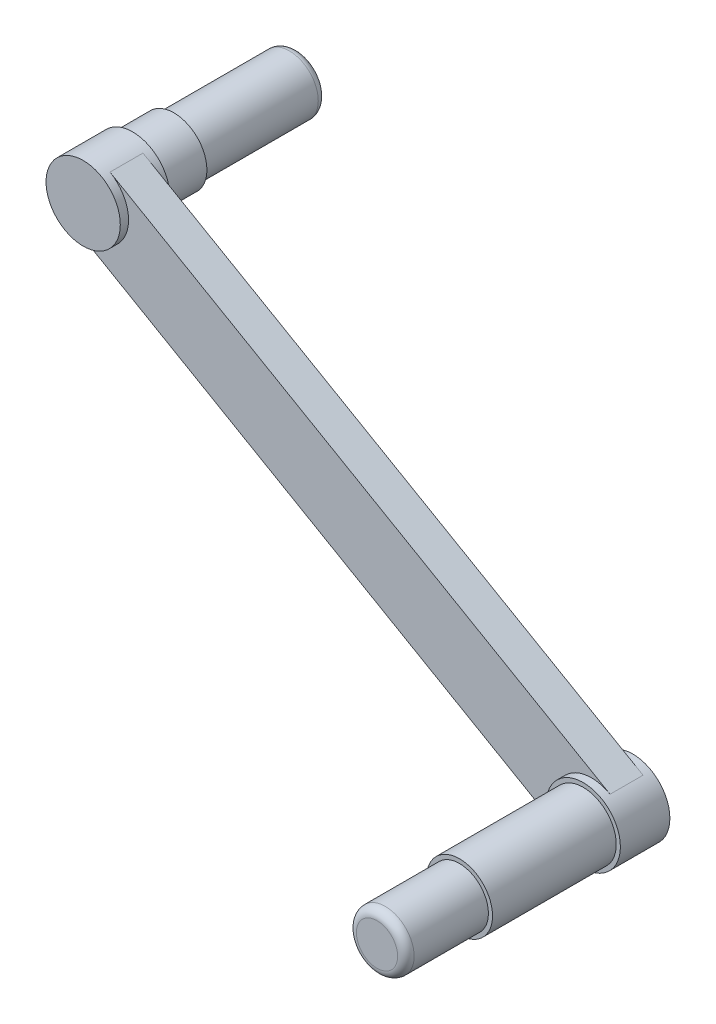
ISO-10303-21;
HEADER;
FILE_DESCRIPTION(('STEP AP214'),'2;1');
FILE_NAME('part.step','',(''),(''),'','','');
FILE_SCHEMA(('AUTOMOTIVE_DESIGN { 1 0 10303 214 1 1 1 1 }'));
ENDSEC;
DATA;
#1=APPLICATION_CONTEXT('core data for automotive mechanical design processes');
#2=APPLICATION_PROTOCOL_DEFINITION('international standard','automotive_design',2000,#1);
#3=PRODUCT_CONTEXT('',#1,'mechanical');
#4=PRODUCT('Part','Part','',(#3));
#5=PRODUCT_RELATED_PRODUCT_CATEGORY('part','',(#4));
#6=PRODUCT_DEFINITION_FORMATION('','',#4);
#7=PRODUCT_DEFINITION_CONTEXT('part definition',#1,'design');
#8=PRODUCT_DEFINITION('design','',#6,#7);
#9=PRODUCT_DEFINITION_SHAPE('','',#8);
#10=(LENGTH_UNIT() NAMED_UNIT(*) SI_UNIT(.MILLI.,.METRE.));
#11=(NAMED_UNIT(*) PLANE_ANGLE_UNIT() SI_UNIT($,.RADIAN.));
#12=(NAMED_UNIT(*) SI_UNIT($,.STERADIAN.) SOLID_ANGLE_UNIT());
#13=UNCERTAINTY_MEASURE_WITH_UNIT(LENGTH_MEASURE(1.E-05),#10,'distance_accuracy_value','');
#14=(GEOMETRIC_REPRESENTATION_CONTEXT(3) GLOBAL_UNCERTAINTY_ASSIGNED_CONTEXT((#13)) GLOBAL_UNIT_ASSIGNED_CONTEXT((#10,
#11,#12)) REPRESENTATION_CONTEXT('',''));
#15=CARTESIAN_POINT('',(0.,0.,0.));
#16=DIRECTION('',(0.,0.,1.));
#17=DIRECTION('',(1.,0.,0.));
#18=AXIS2_PLACEMENT_3D('',#15,#16,#17);
#19=CARTESIAN_POINT('',(0.,0.,10.));
#20=DIRECTION('',(0.,0.,-1.));
#21=DIRECTION('',(-1.,0.,0.));
#22=AXIS2_PLACEMENT_3D('',#19,#20,#21);
#23=CYLINDRICAL_SURFACE('',#22,4.5);
#24=CARTESIAN_POINT('',(0.,0.,5.));
#25=DIRECTION('',(0.,0.,1.));
#26=DIRECTION('',(1.,0.,0.));
#27=AXIS2_PLACEMENT_3D('',#24,#25,#26);
#28=CIRCLE('',#27,4.5);
#29=CARTESIAN_POINT('',(4.5,0.,5.));
#30=VERTEX_POINT('',#29);
#31=EDGE_CURVE('E122',#30,#30,#28,.T.);
#32=ORIENTED_EDGE('',*,*,#31,.T.);
#33=EDGE_LOOP('',(#32));
#34=FACE_BOUND('',#33,.T.);
#35=DIRECTION('',(0.,0.,1.));
#36=VECTOR('',#35,1.);
#37=CARTESIAN_POINT('',(-2.24999999999996,-3.89711431702999,6.));
#38=LINE('',#37,#36);
#39=CARTESIAN_POINT('',(-2.24999999999996,-3.89711431702999,6.));
#40=VERTEX_POINT('',#39);
#41=CARTESIAN_POINT('',(-2.24999999999996,-3.89711431702999,10.));
#42=VERTEX_POINT('',#41);
#43=EDGE_CURVE('E63',#40,#42,#38,.T.);
#44=ORIENTED_EDGE('',*,*,#43,.T.);
#45=CARTESIAN_POINT('',(0.,0.,10.));
#46=DIRECTION('',(0.,0.,1.));
#47=DIRECTION('',(1.,0.,0.));
#48=AXIS2_PLACEMENT_3D('',#45,#46,#47);
#49=CIRCLE('',#48,4.5);
#50=CARTESIAN_POINT('',(2.24999999999997,3.89711431702999,10.));
#51=VERTEX_POINT('',#50);
#52=EDGE_CURVE('E439',#42,#51,#49,.T.);
#53=ORIENTED_EDGE('',*,*,#52,.T.);
#54=DIRECTION('',(0.,0.,1.));
#55=VECTOR('',#54,1.);
#56=CARTESIAN_POINT('',(2.24999999999996,3.89711431702999,6.));
#57=LINE('',#56,#55);
#58=CARTESIAN_POINT('',(2.24999999999996,3.89711431702999,6.));
#59=VERTEX_POINT('',#58);
#60=EDGE_CURVE('E83',#59,#51,#57,.T.);
#61=ORIENTED_EDGE('',*,*,#60,.F.);
#62=CARTESIAN_POINT('',(0.,0.,6.));
#63=DIRECTION('',(0.,0.,1.));
#64=DIRECTION('',(1.,0.,0.));
#65=AXIS2_PLACEMENT_3D('',#62,#63,#64);
#66=CIRCLE('',#65,4.5);
#67=EDGE_CURVE('E108',#40,#59,#66,.T.);
#68=ORIENTED_EDGE('',*,*,#67,.F.);
#69=EDGE_LOOP('',(#44,#53,#61,#68));
#70=FACE_BOUND('',#69,.T.);
#71=CARTESIAN_POINT('',(0.,0.,11.));
#72=DIRECTION('',(0.,0.,1.));
#73=DIRECTION('',(1.,0.,0.));
#74=AXIS2_PLACEMENT_3D('',#71,#72,#73);
#75=CIRCLE('',#74,4.5);
#76=CARTESIAN_POINT('',(4.5,0.,11.));
#77=VERTEX_POINT('',#76);
#78=EDGE_CURVE('E435',#77,#77,#75,.T.);
#79=ORIENTED_EDGE('',*,*,#78,.F.);
#80=EDGE_LOOP('',(#79));
#81=FACE_BOUND('',#80,.T.);
#82=ADVANCED_FACE('F45',(#34,#70,#81),#23,.T.);
#83=CARTESIAN_POINT('',(0.,0.,-15.));
#84=DIRECTION('',(0.,0.,1.));
#85=DIRECTION('',(1.,0.,0.));
#86=AXIS2_PLACEMENT_3D('',#83,#84,#85);
#87=CYLINDRICAL_SURFACE('',#86,3.5);
#88=CARTESIAN_POINT('',(0.,0.,-14.));
#89=DIRECTION('',(0.,0.,1.));
#90=DIRECTION('',(1.,0.,0.));
#91=AXIS2_PLACEMENT_3D('',#88,#89,#90);
#92=CIRCLE('',#91,3.5);
#93=CARTESIAN_POINT('',(3.5,0.,-14.));
#94=VERTEX_POINT('',#93);
#95=EDGE_CURVE('E55',#94,#94,#92,.T.);
#96=ORIENTED_EDGE('',*,*,#95,.T.);
#97=EDGE_LOOP('',(#96));
#98=FACE_BOUND('',#97,.T.);
#99=CARTESIAN_POINT('',(0.,0.,0.));
#100=DIRECTION('',(0.,0.,1.));
#101=DIRECTION('',(1.,0.,0.));
#102=AXIS2_PLACEMENT_3D('',#99,#100,#101);
#103=CIRCLE('',#102,3.5);
#104=CARTESIAN_POINT('',(3.5,0.,0.));
#105=VERTEX_POINT('',#104);
#106=EDGE_CURVE('E103',#105,#105,#103,.T.);
#107=ORIENTED_EDGE('',*,*,#106,.F.);
#108=EDGE_LOOP('',(#107));
#109=FACE_BOUND('',#108,.T.);
#110=ADVANCED_FACE('F149',(#98,#109),#87,.T.);
#111=CARTESIAN_POINT('',(0.,0.,-15.));
#112=DIRECTION('',(0.,0.,1.));
#113=DIRECTION('',(1.,0.,0.));
#114=AXIS2_PLACEMENT_3D('',#111,#112,#113);
#115=PLANE('',#114);
#116=CARTESIAN_POINT('',(0.,0.,-15.));
#117=DIRECTION('',(0.,0.,1.));
#118=DIRECTION('',(1.,0.,0.));
#119=AXIS2_PLACEMENT_3D('',#116,#117,#118);
#120=CIRCLE('',#119,2.5);
#121=CARTESIAN_POINT('',(2.5,0.,-15.));
#122=VERTEX_POINT('',#121);
#123=EDGE_CURVE('E11',#122,#122,#120,.F.);
#124=ORIENTED_EDGE('',*,*,#123,.T.);
#125=EDGE_LOOP('',(#124));
#126=FACE_BOUND('',#125,.T.);
#127=ADVANCED_FACE('F167',(#126),#115,.F.);
#128=CARTESIAN_POINT('',(0.,0.,5.));
#129=DIRECTION('',(0.,0.,-1.));
#130=DIRECTION('',(-1.,0.,0.));
#131=AXIS2_PLACEMENT_3D('',#128,#129,#130);
#132=CYLINDRICAL_SURFACE('',#131,4.);
#133=CARTESIAN_POINT('',(0.,0.,5.));
#134=DIRECTION('',(0.,0.,1.));
#135=DIRECTION('',(1.,0.,0.));
#136=AXIS2_PLACEMENT_3D('',#133,#134,#135);
#137=CIRCLE('',#136,4.);
#138=CARTESIAN_POINT('',(4.,0.,5.));
#139=VERTEX_POINT('',#138);
#140=EDGE_CURVE('E127',#139,#139,#137,.T.);
#141=ORIENTED_EDGE('',*,*,#140,.F.);
#142=EDGE_LOOP('',(#141));
#143=FACE_BOUND('',#142,.T.);
#144=CARTESIAN_POINT('',(0.,0.,0.));
#145=DIRECTION('',(0.,0.,1.));
#146=DIRECTION('',(1.,0.,0.));
#147=AXIS2_PLACEMENT_3D('',#144,#145,#146);
#148=CIRCLE('',#147,4.);
#149=CARTESIAN_POINT('',(4.,0.,0.));
#150=VERTEX_POINT('',#149);
#151=EDGE_CURVE('E126',#150,#150,#148,.T.);
#152=ORIENTED_EDGE('',*,*,#151,.T.);
#153=EDGE_LOOP('',(#152));
#154=FACE_BOUND('',#153,.T.);
#155=ADVANCED_FACE('F178',(#143,#154),#132,.T.);
#156=CARTESIAN_POINT('',(0.,0.,0.));
#157=DIRECTION('',(0.,0.,1.));
#158=DIRECTION('',(1.,0.,0.));
#159=AXIS2_PLACEMENT_3D('',#156,#157,#158);
#160=PLANE('',#159);
#161=ORIENTED_EDGE('',*,*,#106,.T.);
#162=EDGE_LOOP('',(#161));
#163=FACE_BOUND('',#162,.T.);
#164=ORIENTED_EDGE('',*,*,#151,.F.);
#165=EDGE_LOOP('',(#164));
#166=FACE_BOUND('',#165,.T.);
#167=ADVANCED_FACE('F174',(#163,#166),#160,.F.);
#168=CARTESIAN_POINT('',(0.,0.,10.));
#169=DIRECTION('',(0.,0.,1.));
#170=DIRECTION('',(1.,0.,0.));
#171=AXIS2_PLACEMENT_3D('',#168,#169,#170);
#172=PLANE('',#171);
#173=CARTESIAN_POINT('',(60.6217780361655,-34.9999998679334,10.));
#174=DIRECTION('',(0.,0.,1.));
#175=DIRECTION('',(1.,0.,0.));
#176=AXIS2_PLACEMENT_3D('',#173,#174,#175);
#177=CIRCLE('',#176,4.50000000000001);
#178=CARTESIAN_POINT('',(62.8717780361655,-31.1028855509034,10.));
#179=VERTEX_POINT('',#178);
#180=CARTESIAN_POINT('',(58.3717780361656,-38.8971141849634,10.));
#181=VERTEX_POINT('',#180);
#182=EDGE_CURVE('E432',#179,#181,#177,.T.);
#183=ORIENTED_EDGE('',*,*,#182,.F.);
#184=DIRECTION('',(0.866025403784442,-0.499999999999995,0.));
#185=VECTOR('',#184,1.);
#186=CARTESIAN_POINT('',(2.24999999999997,3.89711431702999,10.));
#187=LINE('',#186,#185);
#188=EDGE_CURVE('E113',#51,#179,#187,.T.);
#189=ORIENTED_EDGE('',*,*,#188,.F.);
#190=ORIENTED_EDGE('',*,*,#52,.F.);
#191=DIRECTION('',(0.866025403784442,-0.499999999999995,0.));
#192=VECTOR('',#191,1.);
#193=CARTESIAN_POINT('',(-2.24999999999997,-3.89711431702999,10.));
#194=LINE('',#193,#192);
#195=EDGE_CURVE('E443',#42,#181,#194,.T.);
#196=ORIENTED_EDGE('',*,*,#195,.T.);
#197=EDGE_LOOP('',(#183,#189,#190,#196));
#198=FACE_BOUND('',#197,.T.);
#199=ADVANCED_FACE('F177',(#198),#172,.T.);
#200=CARTESIAN_POINT('',(0.,0.,5.));
#201=DIRECTION('',(0.,0.,1.));
#202=DIRECTION('',(1.,0.,0.));
#203=AXIS2_PLACEMENT_3D('',#200,#201,#202);
#204=PLANE('',#203);
#205=ORIENTED_EDGE('',*,*,#140,.T.);
#206=EDGE_LOOP('',(#205));
#207=FACE_BOUND('',#206,.T.);
#208=ORIENTED_EDGE('',*,*,#31,.F.);
#209=EDGE_LOOP('',(#208));
#210=FACE_BOUND('',#209,.T.);
#211=ADVANCED_FACE('F172',(#207,#210),#204,.F.);
#212=CARTESIAN_POINT('',(-2.24999999999997,-3.89711431702999,6.));
#213=DIRECTION('',(-0.499999999999995,-0.866025403784442,0.));
#214=DIRECTION('',(0.866025403784442,-0.499999999999995,0.));
#215=AXIS2_PLACEMENT_3D('',#212,#213,#214);
#216=PLANE('',#215);
#217=ORIENTED_EDGE('',*,*,#195,.F.);
#218=ORIENTED_EDGE('',*,*,#43,.F.);
#219=DIRECTION('',(0.866025403784442,-0.499999999999995,0.));
#220=VECTOR('',#219,1.);
#221=CARTESIAN_POINT('',(-2.24999999999997,-3.89711431702999,6.));
#222=LINE('',#221,#220);
#223=CARTESIAN_POINT('',(58.3717780361656,-38.8971141849634,6.));
#224=VERTEX_POINT('',#223);
#225=EDGE_CURVE('E110',#40,#224,#222,.T.);
#226=ORIENTED_EDGE('',*,*,#225,.T.);
#227=DIRECTION('',(0.,0.,1.));
#228=VECTOR('',#227,1.);
#229=CARTESIAN_POINT('',(58.3717780361656,-38.8971141849634,6.));
#230=LINE('',#229,#228);
#231=EDGE_CURVE('E73',#224,#181,#230,.T.);
#232=ORIENTED_EDGE('',*,*,#231,.T.);
#233=EDGE_LOOP('',(#217,#218,#226,#232));
#234=FACE_BOUND('',#233,.T.);
#235=ADVANCED_FACE('F211',(#234),#216,.T.);
#236=CARTESIAN_POINT('',(2.24999999999997,3.89711431702999,6.));
#237=DIRECTION('',(-0.499999999999995,-0.866025403784442,0.));
#238=DIRECTION('',(0.866025403784442,-0.499999999999995,0.));
#239=AXIS2_PLACEMENT_3D('',#236,#237,#238);
#240=PLANE('',#239);
#241=ORIENTED_EDGE('',*,*,#188,.T.);
#242=DIRECTION('',(0.,0.,1.));
#243=VECTOR('',#242,1.);
#244=CARTESIAN_POINT('',(62.8717782649109,-31.1028856829696,6.));
#245=LINE('',#244,#243);
#246=CARTESIAN_POINT('',(62.8717782649109,-31.1028856829696,6.));
#247=VERTEX_POINT('',#246);
#248=EDGE_CURVE('E98',#247,#179,#245,.T.);
#249=ORIENTED_EDGE('',*,*,#248,.F.);
#250=DIRECTION('',(0.866025403784442,-0.499999999999995,0.));
#251=VECTOR('',#250,1.);
#252=CARTESIAN_POINT('',(2.24999999999997,3.89711431702999,6.));
#253=LINE('',#252,#251);
#254=EDGE_CURVE('E105',#59,#247,#253,.T.);
#255=ORIENTED_EDGE('',*,*,#254,.F.);
#256=ORIENTED_EDGE('',*,*,#60,.T.);
#257=EDGE_LOOP('',(#241,#249,#255,#256));
#258=FACE_BOUND('',#257,.T.);
#259=ADVANCED_FACE('F112',(#258),#240,.F.);
#260=CARTESIAN_POINT('',(60.6217780361655,-34.9999998679334,6.));
#261=DIRECTION('',(0.,0.,1.));
#262=DIRECTION('',(1.,0.,0.));
#263=AXIS2_PLACEMENT_3D('',#260,#261,#262);
#264=CYLINDRICAL_SURFACE('',#263,4.50000000000001);
#265=ORIENTED_EDGE('',*,*,#248,.T.);
#266=ORIENTED_EDGE('',*,*,#182,.T.);
#267=ORIENTED_EDGE('',*,*,#231,.F.);
#268=CARTESIAN_POINT('',(60.6217780361655,-34.9999998679334,6.));
#269=DIRECTION('',(0.,0.,1.));
#270=DIRECTION('',(1.,0.,0.));
#271=AXIS2_PLACEMENT_3D('',#268,#269,#270);
#272=CIRCLE('',#271,4.50000000000001);
#273=EDGE_CURVE('E92',#247,#224,#272,.T.);
#274=ORIENTED_EDGE('',*,*,#273,.F.);
#275=EDGE_LOOP('',(#265,#266,#267,#274));
#276=FACE_BOUND('',#275,.T.);
#277=CARTESIAN_POINT('',(60.6217780361655,-34.9999998679334,5.));
#278=DIRECTION('',(0.,0.,1.));
#279=DIRECTION('',(1.,0.,0.));
#280=AXIS2_PLACEMENT_3D('',#277,#278,#279);
#281=CIRCLE('',#280,4.50000000000001);
#282=CARTESIAN_POINT('',(65.1217780361655,-34.9999998679334,5.));
#283=VERTEX_POINT('',#282);
#284=EDGE_CURVE('E423',#283,#283,#281,.T.);
#285=ORIENTED_EDGE('',*,*,#284,.T.);
#286=EDGE_LOOP('',(#285));
#287=FACE_BOUND('',#286,.T.);
#288=CARTESIAN_POINT('',(60.6217780361655,-34.9999998679334,11.));
#289=DIRECTION('',(0.,0.,1.));
#290=DIRECTION('',(1.,0.,0.));
#291=AXIS2_PLACEMENT_3D('',#288,#289,#290);
#292=CIRCLE('',#291,4.50000000000001);
#293=CARTESIAN_POINT('',(65.1217780361655,-34.9999998679334,11.));
#294=VERTEX_POINT('',#293);
#295=EDGE_CURVE('E428',#294,#294,#292,.T.);
#296=ORIENTED_EDGE('',*,*,#295,.F.);
#297=EDGE_LOOP('',(#296));
#298=FACE_BOUND('',#297,.T.);
#299=ADVANCED_FACE('F94',(#276,#287,#298),#264,.T.);
#300=CARTESIAN_POINT('',(0.,0.,6.));
#301=DIRECTION('',(0.,0.,1.));
#302=DIRECTION('',(1.,0.,0.));
#303=AXIS2_PLACEMENT_3D('',#300,#301,#302);
#304=PLANE('',#303);
#305=ORIENTED_EDGE('',*,*,#254,.T.);
#306=ORIENTED_EDGE('',*,*,#273,.T.);
#307=ORIENTED_EDGE('',*,*,#225,.F.);
#308=ORIENTED_EDGE('',*,*,#67,.T.);
#309=EDGE_LOOP('',(#305,#306,#307,#308));
#310=FACE_BOUND('',#309,.T.);
#311=ADVANCED_FACE('F106',(#310),#304,.F.);
#312=CARTESIAN_POINT('',(0.,0.,11.));
#313=DIRECTION('',(0.,0.,1.));
#314=DIRECTION('',(1.,0.,0.));
#315=AXIS2_PLACEMENT_3D('',#312,#313,#314);
#316=PLANE('',#315);
#317=ORIENTED_EDGE('',*,*,#78,.T.);
#318=EDGE_LOOP('',(#317));
#319=FACE_BOUND('',#318,.T.);
#320=ADVANCED_FACE('F235',(#319),#316,.T.);
#321=CARTESIAN_POINT('',(60.6217780361655,-34.9999998679334,5.));
#322=DIRECTION('',(0.,0.,1.));
#323=DIRECTION('',(1.,0.,0.));
#324=AXIS2_PLACEMENT_3D('',#321,#322,#323);
#325=PLANE('',#324);
#326=ORIENTED_EDGE('',*,*,#284,.F.);
#327=EDGE_LOOP('',(#326));
#328=FACE_BOUND('',#327,.T.);
#329=ADVANCED_FACE('F242',(#328),#325,.F.);
#330=CARTESIAN_POINT('',(60.6217780361655,-34.9999998679334,11.));
#331=DIRECTION('',(0.,0.,1.));
#332=DIRECTION('',(1.,0.,0.));
#333=AXIS2_PLACEMENT_3D('',#330,#331,#332);
#334=PLANE('',#333);
#335=CARTESIAN_POINT('',(60.6217780361655,-34.9999998679334,11.));
#336=DIRECTION('',(0.,0.,1.));
#337=DIRECTION('',(1.,0.,0.));
#338=AXIS2_PLACEMENT_3D('',#335,#336,#337);
#339=CIRCLE('',#338,4.00000000000001);
#340=CARTESIAN_POINT('',(64.6217780361655,-34.9999998679334,11.));
#341=VERTEX_POINT('',#340);
#342=EDGE_CURVE('E102',#341,#341,#339,.T.);
#343=ORIENTED_EDGE('',*,*,#342,.F.);
#344=EDGE_LOOP('',(#343));
#345=FACE_BOUND('',#344,.T.);
#346=ORIENTED_EDGE('',*,*,#295,.T.);
#347=EDGE_LOOP('',(#346));
#348=FACE_BOUND('',#347,.T.);
#349=ADVANCED_FACE('F250',(#345,#348),#334,.T.);
#350=CARTESIAN_POINT('',(60.6217780361655,-34.9999998679334,26.));
#351=DIRECTION('',(0.,0.,-1.));
#352=DIRECTION('',(-1.,0.,0.));
#353=AXIS2_PLACEMENT_3D('',#350,#351,#352);
#354=CYLINDRICAL_SURFACE('',#353,4.00000000000001);
#355=CARTESIAN_POINT('',(60.6217780361655,-34.9999998679334,26.));
#356=DIRECTION('',(0.,0.,1.));
#357=DIRECTION('',(1.,0.,0.));
#358=AXIS2_PLACEMENT_3D('',#355,#356,#357);
#359=CIRCLE('',#358,4.00000000000001);
#360=CARTESIAN_POINT('',(64.6217780361655,-34.9999998679334,26.));
#361=VERTEX_POINT('',#360);
#362=EDGE_CURVE('E420',#361,#361,#359,.T.);
#363=ORIENTED_EDGE('',*,*,#362,.F.);
#364=EDGE_LOOP('',(#363));
#365=FACE_BOUND('',#364,.T.);
#366=ORIENTED_EDGE('',*,*,#342,.T.);
#367=EDGE_LOOP('',(#366));
#368=FACE_BOUND('',#367,.T.);
#369=ADVANCED_FACE('F258',(#365,#368),#354,.T.);
#370=CARTESIAN_POINT('',(60.6217780361655,-34.9999998679334,26.));
#371=DIRECTION('',(0.,0.,1.));
#372=DIRECTION('',(1.,0.,0.));
#373=AXIS2_PLACEMENT_3D('',#370,#371,#372);
#374=PLANE('',#373);
#375=CARTESIAN_POINT('',(60.6217780361655,-34.9999998679334,26.));
#376=DIRECTION('',(0.,0.,1.));
#377=DIRECTION('',(1.,0.,0.));
#378=AXIS2_PLACEMENT_3D('',#375,#376,#377);
#379=CIRCLE('',#378,3.50000000000001);
#380=CARTESIAN_POINT('',(64.1217780361655,-34.9999998679334,26.));
#381=VERTEX_POINT('',#380);
#382=EDGE_CURVE('E142',#381,#381,#379,.T.);
#383=ORIENTED_EDGE('',*,*,#382,.F.);
#384=EDGE_LOOP('',(#383));
#385=FACE_BOUND('',#384,.T.);
#386=ORIENTED_EDGE('',*,*,#362,.T.);
#387=EDGE_LOOP('',(#386));
#388=FACE_BOUND('',#387,.T.);
#389=ADVANCED_FACE('F266',(#385,#388),#374,.T.);
#390=CARTESIAN_POINT('',(60.6217780361655,-34.9999998679334,36.));
#391=DIRECTION('',(0.,0.,-1.));
#392=DIRECTION('',(-1.,0.,0.));
#393=AXIS2_PLACEMENT_3D('',#390,#391,#392);
#394=CYLINDRICAL_SURFACE('',#393,3.50000000000001);
#395=CARTESIAN_POINT('',(60.6217780361655,-34.9999998679334,35.));
#396=DIRECTION('',(0.,0.,1.));
#397=DIRECTION('',(1.,0.,0.));
#398=AXIS2_PLACEMENT_3D('',#395,#396,#397);
#399=CIRCLE('',#398,3.50000000000001);
#400=CARTESIAN_POINT('',(64.1217780361655,-34.9999998679334,35.));
#401=VERTEX_POINT('',#400);
#402=EDGE_CURVE('E141',#401,#401,#399,.F.);
#403=ORIENTED_EDGE('',*,*,#402,.T.);
#404=EDGE_LOOP('',(#403));
#405=FACE_BOUND('',#404,.T.);
#406=ORIENTED_EDGE('',*,*,#382,.T.);
#407=EDGE_LOOP('',(#406));
#408=FACE_BOUND('',#407,.T.);
#409=ADVANCED_FACE('F274',(#405,#408),#394,.T.);
#410=CARTESIAN_POINT('',(60.6217780361655,-34.9999998679334,36.));
#411=DIRECTION('',(0.,0.,1.));
#412=DIRECTION('',(1.,0.,0.));
#413=AXIS2_PLACEMENT_3D('',#410,#411,#412);
#414=PLANE('',#413);
#415=CARTESIAN_POINT('',(60.6217780361655,-34.9999998679334,36.));
#416=DIRECTION('',(0.,0.,1.));
#417=DIRECTION('',(1.,0.,0.));
#418=AXIS2_PLACEMENT_3D('',#415,#416,#417);
#419=CIRCLE('',#418,2.50000000000001);
#420=CARTESIAN_POINT('',(63.1217780361655,-34.9999998679334,36.));
#421=VERTEX_POINT('',#420);
#422=EDGE_CURVE('E137',#421,#421,#419,.T.);
#423=ORIENTED_EDGE('',*,*,#422,.T.);
#424=EDGE_LOOP('',(#423));
#425=FACE_BOUND('',#424,.T.);
#426=ADVANCED_FACE('F158',(#425),#414,.T.);
#427=CARTESIAN_POINT('',(60.6217780361655,-34.9999998679334,35.));
#428=DIRECTION('',(0.,0.,1.));
#429=DIRECTION('',(1.,0.,0.));
#430=AXIS2_PLACEMENT_3D('',#427,#428,#429);
#431=TOROIDAL_SURFACE('',#430,2.50000000000001,1.);
#432=ORIENTED_EDGE('',*,*,#402,.F.);
#433=EDGE_LOOP('',(#432));
#434=FACE_BOUND('',#433,.T.);
#435=ORIENTED_EDGE('',*,*,#422,.F.);
#436=EDGE_LOOP('',(#435));
#437=FACE_BOUND('',#436,.T.);
#438=ADVANCED_FACE('F153',(#434,#437),#431,.T.);
#439=CARTESIAN_POINT('',(0.,0.,-14.));
#440=DIRECTION('',(0.,0.,1.));
#441=DIRECTION('',(1.,0.,0.));
#442=AXIS2_PLACEMENT_3D('',#439,#440,#441);
#443=TOROIDAL_SURFACE('',#442,2.5,1.);
#444=ORIENTED_EDGE('',*,*,#123,.F.);
#445=EDGE_LOOP('',(#444));
#446=FACE_BOUND('',#445,.T.);
#447=ORIENTED_EDGE('',*,*,#95,.F.);
#448=EDGE_LOOP('',(#447));
#449=FACE_BOUND('',#448,.T.);
#450=ADVANCED_FACE('F47',(#446,#449),#443,.T.);
#451=CLOSED_SHELL('',(#82,#110,#127,#155,#167,#199,#211,#235,#259,#299,#311,#320,#329,#349,#369,
#389,#409,#426,#438,#450));
#452=MANIFOLD_SOLID_BREP('B2',#451);
#453=ADVANCED_BREP_SHAPE_REPRESENTATION('',(#18,#452),#14);
#454=SHAPE_DEFINITION_REPRESENTATION(#9,#453);
ENDSEC;
END-ISO-10303-21;
